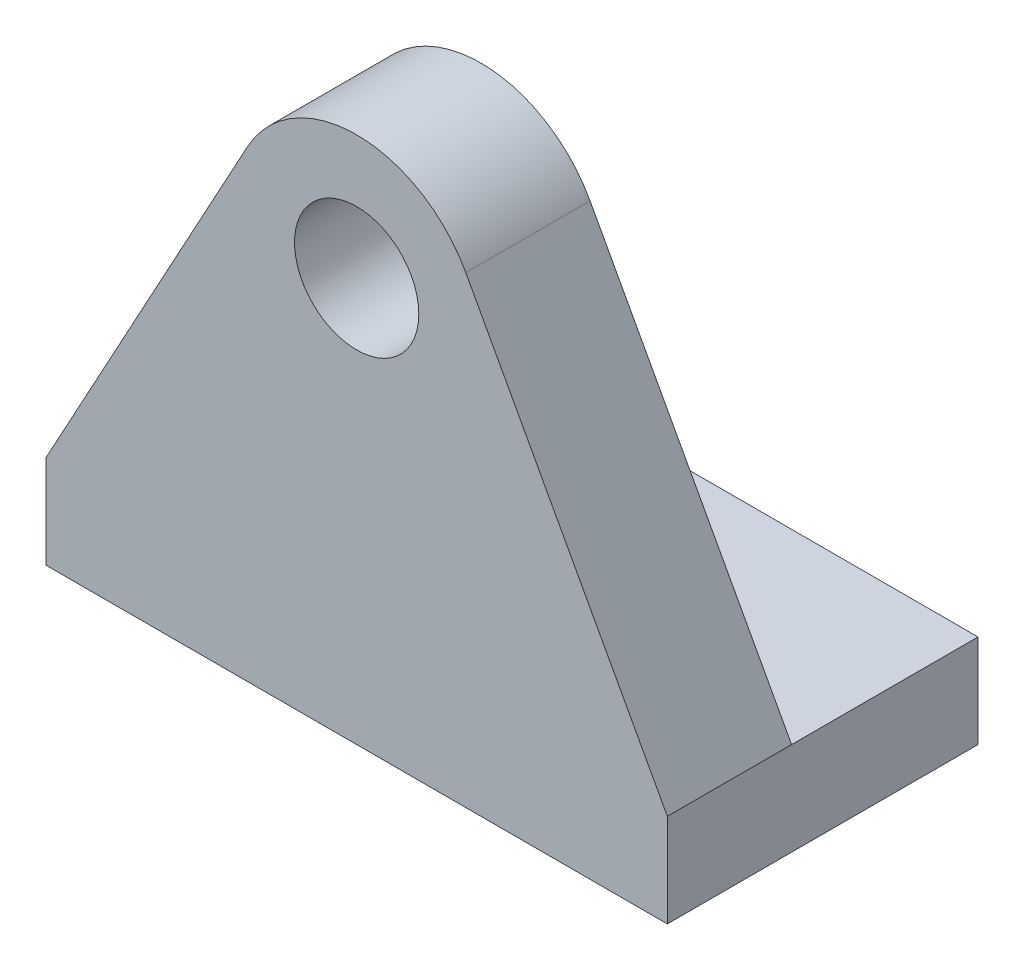
ISO-10303-21;
HEADER;
FILE_DESCRIPTION(('STEP AP214'),'2;1');
FILE_NAME('part.step','',(''),(''),'','','');
FILE_SCHEMA(('AUTOMOTIVE_DESIGN { 1 0 10303 214 1 1 1 1 }'));
ENDSEC;
DATA;
#1=APPLICATION_CONTEXT('core data for automotive mechanical design processes');
#2=APPLICATION_PROTOCOL_DEFINITION('international standard','automotive_design',2000,#1);
#3=PRODUCT_CONTEXT('',#1,'mechanical');
#4=PRODUCT('Part','Part','',(#3));
#5=PRODUCT_RELATED_PRODUCT_CATEGORY('part','',(#4));
#6=PRODUCT_DEFINITION_FORMATION('','',#4);
#7=PRODUCT_DEFINITION_CONTEXT('part definition',#1,'design');
#8=PRODUCT_DEFINITION('design','',#6,#7);
#9=PRODUCT_DEFINITION_SHAPE('','',#8);
#10=(LENGTH_UNIT() NAMED_UNIT(*) SI_UNIT(.MILLI.,.METRE.));
#11=(NAMED_UNIT(*) PLANE_ANGLE_UNIT() SI_UNIT($,.RADIAN.));
#12=(NAMED_UNIT(*) SI_UNIT($,.STERADIAN.) SOLID_ANGLE_UNIT());
#13=UNCERTAINTY_MEASURE_WITH_UNIT(LENGTH_MEASURE(1.E-05),#10,'distance_accuracy_value','');
#14=(GEOMETRIC_REPRESENTATION_CONTEXT(3) GLOBAL_UNCERTAINTY_ASSIGNED_CONTEXT((#13)) GLOBAL_UNIT_ASSIGNED_CONTEXT((#10,
#11,#12)) REPRESENTATION_CONTEXT('',''));
#15=CARTESIAN_POINT('',(0.,0.,0.));
#16=DIRECTION('',(0.,0.,1.));
#17=DIRECTION('',(1.,0.,0.));
#18=AXIS2_PLACEMENT_3D('',#15,#16,#17);
#19=CARTESIAN_POINT('',(0.,0.,4.));
#20=DIRECTION('',(0.,0.,1.));
#21=DIRECTION('',(1.,0.,0.));
#22=AXIS2_PLACEMENT_3D('',#19,#20,#21);
#23=PLANE('',#22);
#24=DIRECTION('',(-0.478232998312527,-0.878232998312527,0.));
#25=VECTOR('',#24,1.);
#26=CARTESIAN_POINT('',(-10.,-10.,4.));
#27=LINE('',#26,#25);
#28=CARTESIAN_POINT('',(-3.51293199325011,1.91293199325011,4.));
#29=VERTEX_POINT('',#28);
#30=CARTESIAN_POINT('',(-10.,-10.,4.));
#31=VERTEX_POINT('',#30);
#32=EDGE_CURVE('E76',#29,#31,#27,.T.);
#33=ORIENTED_EDGE('',*,*,#32,.T.);
#34=DIRECTION('',(0.,-1.,0.));
#35=VECTOR('',#34,1.);
#36=CARTESIAN_POINT('',(-10.,-10.,4.));
#37=LINE('',#36,#35);
#38=CARTESIAN_POINT('',(-10.,-13.,4.));
#39=VERTEX_POINT('',#38);
#40=EDGE_CURVE('E133',#31,#39,#37,.T.);
#41=ORIENTED_EDGE('',*,*,#40,.T.);
#42=DIRECTION('',(1.,0.,0.));
#43=VECTOR('',#42,1.);
#44=CARTESIAN_POINT('',(-10.,-13.,4.));
#45=LINE('',#44,#43);
#46=CARTESIAN_POINT('',(10.,-13.,4.));
#47=VERTEX_POINT('',#46);
#48=EDGE_CURVE('E106',#39,#47,#45,.T.);
#49=ORIENTED_EDGE('',*,*,#48,.T.);
#50=DIRECTION('',(0.,1.,0.));
#51=VECTOR('',#50,1.);
#52=CARTESIAN_POINT('',(10.,-10.,4.));
#53=LINE('',#52,#51);
#54=CARTESIAN_POINT('',(10.,-10.,4.));
#55=VERTEX_POINT('',#54);
#56=EDGE_CURVE('E126',#47,#55,#53,.T.);
#57=ORIENTED_EDGE('',*,*,#56,.T.);
#58=DIRECTION('',(-0.478232998312527,0.878232998312527,0.));
#59=VECTOR('',#58,1.);
#60=CARTESIAN_POINT('',(10.,-10.,4.));
#61=LINE('',#60,#59);
#62=CARTESIAN_POINT('',(3.51293199325011,1.91293199325011,4.));
#63=VERTEX_POINT('',#62);
#64=EDGE_CURVE('E152',#55,#63,#61,.T.);
#65=ORIENTED_EDGE('',*,*,#64,.T.);
#66=CARTESIAN_POINT('',(0.,0.,4.));
#67=DIRECTION('',(0.,0.,1.));
#68=DIRECTION('',(1.,0.,0.));
#69=AXIS2_PLACEMENT_3D('',#66,#67,#68);
#70=CIRCLE('',#69,4.);
#71=EDGE_CURVE('E50',#63,#29,#70,.T.);
#72=ORIENTED_EDGE('',*,*,#71,.T.);
#73=EDGE_LOOP('',(#33,#41,#49,#57,#65,#72));
#74=FACE_BOUND('',#73,.T.);
#75=CARTESIAN_POINT('',(0.,0.,4.));
#76=DIRECTION('',(0.,0.,1.));
#77=DIRECTION('',(1.,0.,0.));
#78=AXIS2_PLACEMENT_3D('',#75,#76,#77);
#79=CIRCLE('',#78,2.);
#80=CARTESIAN_POINT('',(2.,0.,4.));
#81=VERTEX_POINT('',#80);
#82=EDGE_CURVE('E145',#81,#81,#79,.T.);
#83=ORIENTED_EDGE('',*,*,#82,.F.);
#84=EDGE_LOOP('',(#83));
#85=FACE_BOUND('',#84,.T.);
#86=ADVANCED_FACE('F31',(#74,#85),#23,.T.);
#87=CARTESIAN_POINT('',(0.,0.,0.));
#88=DIRECTION('',(0.,0.,1.));
#89=DIRECTION('',(1.,0.,0.));
#90=AXIS2_PLACEMENT_3D('',#87,#88,#89);
#91=PLANE('',#90);
#92=DIRECTION('',(-0.478232998312527,-0.878232998312527,0.));
#93=VECTOR('',#92,1.);
#94=CARTESIAN_POINT('',(-10.,-10.,0.));
#95=LINE('',#94,#93);
#96=CARTESIAN_POINT('',(-3.51293199325011,1.91293199325011,0.));
#97=VERTEX_POINT('',#96);
#98=CARTESIAN_POINT('',(-10.,-10.,0.));
#99=VERTEX_POINT('',#98);
#100=EDGE_CURVE('E148',#97,#99,#95,.T.);
#101=ORIENTED_EDGE('',*,*,#100,.F.);
#102=CARTESIAN_POINT('',(0.,0.,0.));
#103=DIRECTION('',(0.,0.,1.));
#104=DIRECTION('',(1.,0.,0.));
#105=AXIS2_PLACEMENT_3D('',#102,#103,#104);
#106=CIRCLE('',#105,4.);
#107=CARTESIAN_POINT('',(3.51293199325011,1.91293199325011,0.));
#108=VERTEX_POINT('',#107);
#109=EDGE_CURVE('E71',#108,#97,#106,.T.);
#110=ORIENTED_EDGE('',*,*,#109,.F.);
#111=DIRECTION('',(-0.478232998312527,0.878232998312527,0.));
#112=VECTOR('',#111,1.);
#113=CARTESIAN_POINT('',(10.,-10.,0.));
#114=LINE('',#113,#112);
#115=CARTESIAN_POINT('',(10.,-10.,0.));
#116=VERTEX_POINT('',#115);
#117=EDGE_CURVE('E65',#116,#108,#114,.T.);
#118=ORIENTED_EDGE('',*,*,#117,.F.);
#119=DIRECTION('',(1.,0.,0.));
#120=VECTOR('',#119,1.);
#121=CARTESIAN_POINT('',(-10.,-10.,0.));
#122=LINE('',#121,#120);
#123=EDGE_CURVE('E160',#99,#116,#122,.T.);
#124=ORIENTED_EDGE('',*,*,#123,.F.);
#125=EDGE_LOOP('',(#101,#110,#118,#124));
#126=FACE_BOUND('',#125,.T.);
#127=CARTESIAN_POINT('',(0.,0.,0.));
#128=DIRECTION('',(0.,0.,1.));
#129=DIRECTION('',(1.,0.,0.));
#130=AXIS2_PLACEMENT_3D('',#127,#128,#129);
#131=CIRCLE('',#130,2.);
#132=CARTESIAN_POINT('',(2.,0.,0.));
#133=VERTEX_POINT('',#132);
#134=EDGE_CURVE('E143',#133,#133,#131,.T.);
#135=ORIENTED_EDGE('',*,*,#134,.T.);
#136=EDGE_LOOP('',(#135));
#137=FACE_BOUND('',#136,.T.);
#138=ADVANCED_FACE('F180',(#126,#137),#91,.F.);
#139=CARTESIAN_POINT('',(-10.,-10.,4.));
#140=DIRECTION('',(0.878232998312527,-0.478232998312527,0.));
#141=DIRECTION('',(0.478232998312527,0.878232998312527,0.));
#142=AXIS2_PLACEMENT_3D('',#139,#140,#141);
#143=PLANE('',#142);
#144=ORIENTED_EDGE('',*,*,#100,.T.);
#145=DIRECTION('',(0.,0.,-1.));
#146=VECTOR('',#145,1.);
#147=CARTESIAN_POINT('',(-10.,-10.,4.));
#148=LINE('',#147,#146);
#149=EDGE_CURVE('E11',#31,#99,#148,.T.);
#150=ORIENTED_EDGE('',*,*,#149,.F.);
#151=ORIENTED_EDGE('',*,*,#32,.F.);
#152=DIRECTION('',(0.,0.,-1.));
#153=VECTOR('',#152,1.);
#154=CARTESIAN_POINT('',(-3.51293199325011,1.91293199325011,4.));
#155=LINE('',#154,#153);
#156=EDGE_CURVE('E155',#29,#97,#155,.T.);
#157=ORIENTED_EDGE('',*,*,#156,.T.);
#158=EDGE_LOOP('',(#144,#150,#151,#157));
#159=FACE_BOUND('',#158,.T.);
#160=ADVANCED_FACE('F33',(#159),#143,.F.);
#161=CARTESIAN_POINT('',(10.,-10.,4.));
#162=DIRECTION('',(-0.878232998312527,-0.478232998312527,0.));
#163=DIRECTION('',(0.478232998312527,-0.878232998312527,0.));
#164=AXIS2_PLACEMENT_3D('',#161,#162,#163);
#165=PLANE('',#164);
#166=ORIENTED_EDGE('',*,*,#117,.T.);
#167=DIRECTION('',(0.,0.,-1.));
#168=VECTOR('',#167,1.);
#169=CARTESIAN_POINT('',(3.51293199325011,1.91293199325011,4.));
#170=LINE('',#169,#168);
#171=EDGE_CURVE('E277',#63,#108,#170,.T.);
#172=ORIENTED_EDGE('',*,*,#171,.F.);
#173=ORIENTED_EDGE('',*,*,#64,.F.);
#174=DIRECTION('',(0.,0.,-1.));
#175=VECTOR('',#174,1.);
#176=CARTESIAN_POINT('',(10.,-10.,4.));
#177=LINE('',#176,#175);
#178=EDGE_CURVE('E41',#55,#116,#177,.T.);
#179=ORIENTED_EDGE('',*,*,#178,.T.);
#180=EDGE_LOOP('',(#166,#172,#173,#179));
#181=FACE_BOUND('',#180,.T.);
#182=ADVANCED_FACE('F196',(#181),#165,.F.);
#183=CARTESIAN_POINT('',(0.,0.,4.));
#184=DIRECTION('',(0.,0.,-1.));
#185=DIRECTION('',(-1.,0.,0.));
#186=AXIS2_PLACEMENT_3D('',#183,#184,#185);
#187=CYLINDRICAL_SURFACE('',#186,4.);
#188=ORIENTED_EDGE('',*,*,#109,.T.);
#189=ORIENTED_EDGE('',*,*,#156,.F.);
#190=ORIENTED_EDGE('',*,*,#71,.F.);
#191=ORIENTED_EDGE('',*,*,#171,.T.);
#192=EDGE_LOOP('',(#188,#189,#190,#191));
#193=FACE_BOUND('',#192,.T.);
#194=ADVANCED_FACE('F187',(#193),#187,.T.);
#195=CARTESIAN_POINT('',(0.,0.,4.));
#196=DIRECTION('',(0.,0.,-1.));
#197=DIRECTION('',(-1.,0.,0.));
#198=AXIS2_PLACEMENT_3D('',#195,#196,#197);
#199=CYLINDRICAL_SURFACE('',#198,2.);
#200=ORIENTED_EDGE('',*,*,#82,.T.);
#201=EDGE_LOOP('',(#200));
#202=FACE_BOUND('',#201,.T.);
#203=ORIENTED_EDGE('',*,*,#134,.F.);
#204=EDGE_LOOP('',(#203));
#205=FACE_BOUND('',#204,.T.);
#206=ADVANCED_FACE('F184',(#202,#205),#199,.F.);
#207=CARTESIAN_POINT('',(-10.,-10.,-6.));
#208=DIRECTION('',(-1.,0.,0.));
#209=DIRECTION('',(0.,0.,1.));
#210=AXIS2_PLACEMENT_3D('',#207,#208,#209);
#211=PLANE('',#210);
#212=ORIENTED_EDGE('',*,*,#40,.F.);
#213=ORIENTED_EDGE('',*,*,#149,.T.);
#214=DIRECTION('',(0.,0.,1.));
#215=VECTOR('',#214,1.);
#216=CARTESIAN_POINT('',(-10.,-10.,-6.));
#217=LINE('',#216,#215);
#218=CARTESIAN_POINT('',(-10.,-10.,-6.));
#219=VERTEX_POINT('',#218);
#220=EDGE_CURVE('E125',#219,#99,#217,.T.);
#221=ORIENTED_EDGE('',*,*,#220,.F.);
#222=DIRECTION('',(0.,-1.,0.));
#223=VECTOR('',#222,1.);
#224=CARTESIAN_POINT('',(-10.,-10.,-6.));
#225=LINE('',#224,#223);
#226=CARTESIAN_POINT('',(-10.,-13.,-6.));
#227=VERTEX_POINT('',#226);
#228=EDGE_CURVE('E118',#219,#227,#225,.T.);
#229=ORIENTED_EDGE('',*,*,#228,.T.);
#230=DIRECTION('',(0.,0.,1.));
#231=VECTOR('',#230,1.);
#232=CARTESIAN_POINT('',(-10.,-13.,-6.));
#233=LINE('',#232,#231);
#234=EDGE_CURVE('E101',#227,#39,#233,.T.);
#235=ORIENTED_EDGE('',*,*,#234,.T.);
#236=EDGE_LOOP('',(#212,#213,#221,#229,#235));
#237=FACE_BOUND('',#236,.T.);
#238=ADVANCED_FACE('F123',(#237),#211,.T.);
#239=CARTESIAN_POINT('',(-10.,-10.,-6.));
#240=DIRECTION('',(0.,1.,0.));
#241=DIRECTION('',(0.,0.,1.));
#242=AXIS2_PLACEMENT_3D('',#239,#240,#241);
#243=PLANE('',#242);
#244=ORIENTED_EDGE('',*,*,#220,.T.);
#245=ORIENTED_EDGE('',*,*,#123,.T.);
#246=DIRECTION('',(0.,0.,1.));
#247=VECTOR('',#246,1.);
#248=CARTESIAN_POINT('',(10.,-10.,-6.));
#249=LINE('',#248,#247);
#250=CARTESIAN_POINT('',(10.,-10.,-6.));
#251=VERTEX_POINT('',#250);
#252=EDGE_CURVE('E144',#251,#116,#249,.T.);
#253=ORIENTED_EDGE('',*,*,#252,.F.);
#254=DIRECTION('',(-1.,0.,0.));
#255=VECTOR('',#254,1.);
#256=CARTESIAN_POINT('',(-10.,-10.,-6.));
#257=LINE('',#256,#255);
#258=EDGE_CURVE('E111',#251,#219,#257,.T.);
#259=ORIENTED_EDGE('',*,*,#258,.T.);
#260=EDGE_LOOP('',(#244,#245,#253,#259));
#261=FACE_BOUND('',#260,.T.);
#262=ADVANCED_FACE('F172',(#261),#243,.T.);
#263=CARTESIAN_POINT('',(10.,-10.,-6.));
#264=DIRECTION('',(1.,0.,0.));
#265=DIRECTION('',(0.,0.,-1.));
#266=AXIS2_PLACEMENT_3D('',#263,#264,#265);
#267=PLANE('',#266);
#268=ORIENTED_EDGE('',*,*,#56,.F.);
#269=DIRECTION('',(0.,0.,1.));
#270=VECTOR('',#269,1.);
#271=CARTESIAN_POINT('',(10.,-13.,-6.));
#272=LINE('',#271,#270);
#273=CARTESIAN_POINT('',(10.,-13.,-6.));
#274=VERTEX_POINT('',#273);
#275=EDGE_CURVE('E110',#274,#47,#272,.T.);
#276=ORIENTED_EDGE('',*,*,#275,.F.);
#277=DIRECTION('',(0.,1.,0.));
#278=VECTOR('',#277,1.);
#279=CARTESIAN_POINT('',(10.,-10.,-6.));
#280=LINE('',#279,#278);
#281=EDGE_CURVE('E121',#274,#251,#280,.T.);
#282=ORIENTED_EDGE('',*,*,#281,.T.);
#283=ORIENTED_EDGE('',*,*,#252,.T.);
#284=ORIENTED_EDGE('',*,*,#178,.F.);
#285=EDGE_LOOP('',(#268,#276,#282,#283,#284));
#286=FACE_BOUND('',#285,.T.);
#287=ADVANCED_FACE('F177',(#286),#267,.T.);
#288=CARTESIAN_POINT('',(-10.,-13.,-6.));
#289=DIRECTION('',(0.,-1.,0.));
#290=DIRECTION('',(0.,0.,-1.));
#291=AXIS2_PLACEMENT_3D('',#288,#289,#290);
#292=PLANE('',#291);
#293=ORIENTED_EDGE('',*,*,#48,.F.);
#294=ORIENTED_EDGE('',*,*,#234,.F.);
#295=DIRECTION('',(1.,0.,0.));
#296=VECTOR('',#295,1.);
#297=CARTESIAN_POINT('',(-10.,-13.,-6.));
#298=LINE('',#297,#296);
#299=EDGE_CURVE('E104',#227,#274,#298,.T.);
#300=ORIENTED_EDGE('',*,*,#299,.T.);
#301=ORIENTED_EDGE('',*,*,#275,.T.);
#302=EDGE_LOOP('',(#293,#294,#300,#301));
#303=FACE_BOUND('',#302,.T.);
#304=ADVANCED_FACE('F103',(#303),#292,.T.);
#305=CARTESIAN_POINT('',(-10.,-13.,-6.));
#306=DIRECTION('',(0.,0.,1.));
#307=DIRECTION('',(1.,0.,0.));
#308=AXIS2_PLACEMENT_3D('',#305,#306,#307);
#309=PLANE('',#308);
#310=ORIENTED_EDGE('',*,*,#228,.F.);
#311=ORIENTED_EDGE('',*,*,#258,.F.);
#312=ORIENTED_EDGE('',*,*,#281,.F.);
#313=ORIENTED_EDGE('',*,*,#299,.F.);
#314=EDGE_LOOP('',(#310,#311,#312,#313));
#315=FACE_BOUND('',#314,.T.);
#316=ADVANCED_FACE('F116',(#315),#309,.F.);
#317=CLOSED_SHELL('',(#86,#138,#160,#182,#194,#206,#238,#262,#287,#304,#316));
#318=MANIFOLD_SOLID_BREP('B2',#317);
#319=ADVANCED_BREP_SHAPE_REPRESENTATION('',(#18,#318),#14);
#320=SHAPE_DEFINITION_REPRESENTATION(#9,#319);
ENDSEC;
END-ISO-10303-21;
